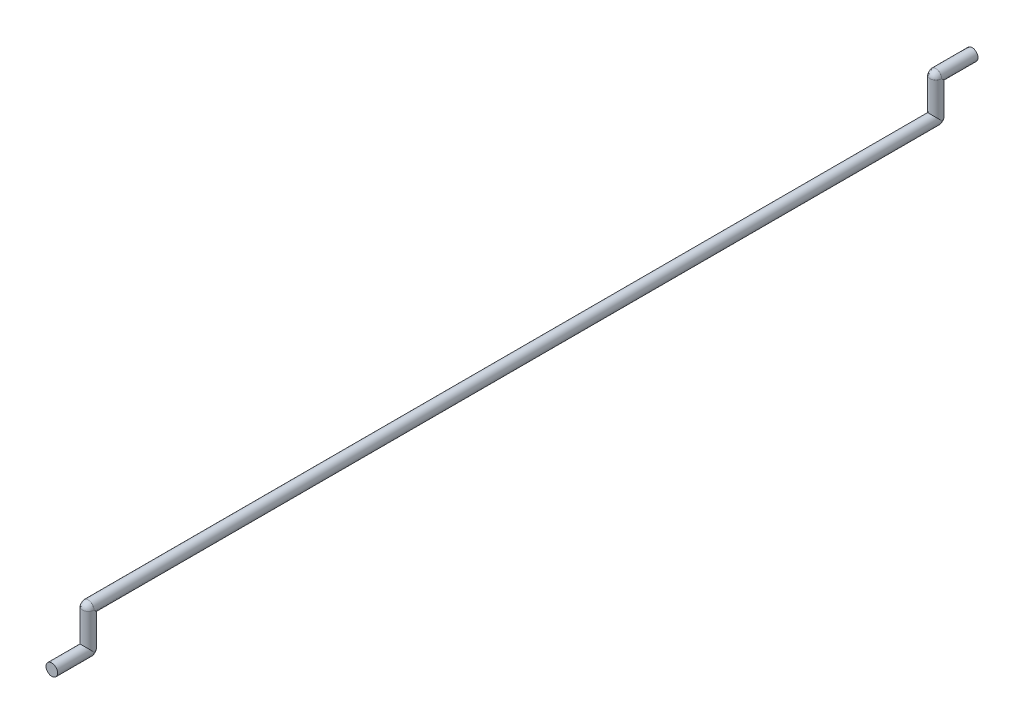
ISO-10303-21;
HEADER;
FILE_DESCRIPTION(('STEP AP214'),'2;1');
FILE_NAME('part.step','',(''),(''),'','','');
FILE_SCHEMA(('AUTOMOTIVE_DESIGN { 1 0 10303 214 1 1 1 1 }'));
ENDSEC;
DATA;
#1=APPLICATION_CONTEXT('core data for automotive mechanical design processes');
#2=APPLICATION_PROTOCOL_DEFINITION('international standard','automotive_design',2000,#1);
#3=PRODUCT_CONTEXT('',#1,'mechanical');
#4=PRODUCT('Part','Part','',(#3));
#5=PRODUCT_RELATED_PRODUCT_CATEGORY('part','',(#4));
#6=PRODUCT_DEFINITION_FORMATION('','',#4);
#7=PRODUCT_DEFINITION_CONTEXT('part definition',#1,'design');
#8=PRODUCT_DEFINITION('design','',#6,#7);
#9=PRODUCT_DEFINITION_SHAPE('','',#8);
#10=(LENGTH_UNIT() NAMED_UNIT(*) SI_UNIT(.MILLI.,.METRE.));
#11=(NAMED_UNIT(*) PLANE_ANGLE_UNIT() SI_UNIT($,.RADIAN.));
#12=(NAMED_UNIT(*) SI_UNIT($,.STERADIAN.) SOLID_ANGLE_UNIT());
#13=UNCERTAINTY_MEASURE_WITH_UNIT(LENGTH_MEASURE(1.E-05),#10,'distance_accuracy_value','');
#14=(GEOMETRIC_REPRESENTATION_CONTEXT(3) GLOBAL_UNCERTAINTY_ASSIGNED_CONTEXT((#13)) GLOBAL_UNIT_ASSIGNED_CONTEXT((#10,
#11,#12)) REPRESENTATION_CONTEXT('',''));
#15=CARTESIAN_POINT('',(0.,0.,0.));
#16=DIRECTION('',(0.,0.,1.));
#17=DIRECTION('',(1.,0.,0.));
#18=AXIS2_PLACEMENT_3D('',#15,#16,#17);
#19=CARTESIAN_POINT('',(0.,-2.54,29.591));
#20=DIRECTION('',(0.,1.,0.));
#21=DIRECTION('',(0.,0.,1.));
#22=AXIS2_PLACEMENT_3D('',#19,#20,#21);
#23=CYLINDRICAL_SURFACE('',#22,0.4064);
#24=CARTESIAN_POINT('',(-0.4064,0.,29.591));
#25=CARTESIAN_POINT('',(-0.4064,0.,29.6441976352546));
#26=CARTESIAN_POINT('',(-0.385247228577067,0.,29.7505931969916));
#27=CARTESIAN_POINT('',(-0.294884096127371,0.,29.8858240319345));
#28=CARTESIAN_POINT('',(-0.159580434220267,0.,29.9762683571422));
#29=CARTESIAN_POINT('',(-0.0531976352546505,0.,29.9974));
#30=CARTESIAN_POINT('',(0.0531976352546512,0.,29.9974));
#31=CARTESIAN_POINT('',(0.159593196991644,0.,29.9762472285771));
#32=CARTESIAN_POINT('',(0.294824031934544,0.,29.8858840961273));
#33=CARTESIAN_POINT('',(0.385268357142189,0.,29.7505804342203));
#34=CARTESIAN_POINT('',(0.4064,0.,29.6441976352546));
#35=CARTESIAN_POINT('',(0.4064,0.,29.591));
#36=B_SPLINE_CURVE_WITH_KNOTS('',3,(#24,#25,#26,#27,#28,#29,#30,#31,#32,#33,#34,#35),
.UNSPECIFIED.,.F.,.F.,(4,1,1,1,2,1,1,1,4),(0.,0.125,0.25,0.375,0.5,0.625,0.75,0.875,1.),.UNSPECIFIED.);
#37=CARTESIAN_POINT('',(-0.4064,0.,29.591));
#38=VERTEX_POINT('',#37);
#39=CARTESIAN_POINT('',(0.4064,0.,29.591));
#40=VERTEX_POINT('',#39);
#41=EDGE_CURVE('E162',#38,#40,#36,.T.);
#42=ORIENTED_EDGE('',*,*,#41,.F.);
#43=CARTESIAN_POINT('',(0.,0.,29.591));
#44=DIRECTION('',(0.,-0.707106781186548,0.707106781186547));
#45=DIRECTION('',(0.,0.707106781186548,0.707106781186547));
#46=AXIS2_PLACEMENT_3D('',#43,#44,#45);
#47=ELLIPSE('',#46,0.574736391748426,0.4064);
#48=EDGE_CURVE('E161',#38,#40,#47,.T.);
#49=ORIENTED_EDGE('',*,*,#48,.T.);
#50=EDGE_LOOP('',(#42,#49));
#51=FACE_BOUND('',#50,.T.);
#52=CARTESIAN_POINT('',(-0.4064,-2.54,29.591));
#53=CARTESIAN_POINT('',(-0.4064,-2.54,29.5378023647453));
#54=CARTESIAN_POINT('',(-0.38524722857707,-2.54,29.4314068030083));
#55=CARTESIAN_POINT('',(-0.294884096127375,-2.54,29.2961759680655));
#56=CARTESIAN_POINT('',(-0.159580434220265,-2.54,29.2057316428578));
#57=CARTESIAN_POINT('',(-0.0531976352546502,-2.54,29.1846));
#58=CARTESIAN_POINT('',(0.0531976352546497,-2.54,29.1846));
#59=CARTESIAN_POINT('',(0.159593196991646,-2.54,29.2057527714229));
#60=CARTESIAN_POINT('',(0.294824031934541,-2.54,29.2961159038726));
#61=CARTESIAN_POINT('',(0.385268357142195,-2.54,29.4314195657797));
#62=CARTESIAN_POINT('',(0.4064,-2.54,29.5378023647453));
#63=CARTESIAN_POINT('',(0.4064,-2.54,29.591));
#64=B_SPLINE_CURVE_WITH_KNOTS('',3,(#52,#53,#54,#55,#56,#57,#58,#59,#60,#61,#62,#63),
.UNSPECIFIED.,.F.,.F.,(4,1,1,1,2,1,1,1,4),(0.,0.125,0.25,0.375,0.5,0.625,0.75,0.875,1.),.UNSPECIFIED.);
#65=CARTESIAN_POINT('',(0.4064,-2.54,29.591));
#66=VERTEX_POINT('',#65);
#67=CARTESIAN_POINT('',(-0.4064,-2.54,29.591));
#68=VERTEX_POINT('',#67);
#69=EDGE_CURVE('E155',#66,#68,#64,.F.);
#70=ORIENTED_EDGE('',*,*,#69,.T.);
#71=CARTESIAN_POINT('',(0.,-2.54,29.591));
#72=DIRECTION('',(0.,0.707106781186547,-0.707106781186547));
#73=DIRECTION('',(0.,0.707106781186547,0.707106781186547));
#74=AXIS2_PLACEMENT_3D('',#71,#72,#73);
#75=ELLIPSE('',#74,0.574736391748426,0.4064);
#76=EDGE_CURVE('E165',#68,#66,#75,.T.);
#77=ORIENTED_EDGE('',*,*,#76,.T.);
#78=EDGE_LOOP('',(#70,#77));
#79=FACE_BOUND('',#78,.T.);
#80=ADVANCED_FACE('F113',(#51,#79),#23,.T.);
#81=CARTESIAN_POINT('',(0.,2.54,-29.591));
#82=DIRECTION('',(0.,-1.,0.));
#83=DIRECTION('',(0.,0.,-1.));
#84=AXIS2_PLACEMENT_3D('',#81,#82,#83);
#85=CYLINDRICAL_SURFACE('',#84,0.4064);
#86=CARTESIAN_POINT('',(0.,0.,-29.591));
#87=DIRECTION('',(0.,-0.707106781186548,0.707106781186547));
#88=DIRECTION('',(0.,0.707106781186548,0.707106781186547));
#89=AXIS2_PLACEMENT_3D('',#86,#87,#88);
#90=ELLIPSE('',#89,0.574736391748425,0.4064);
#91=CARTESIAN_POINT('',(0.4064,0.,-29.591));
#92=VERTEX_POINT('',#91);
#93=CARTESIAN_POINT('',(-0.4064,0.,-29.591));
#94=VERTEX_POINT('',#93);
#95=EDGE_CURVE('E259',#92,#94,#90,.T.);
#96=ORIENTED_EDGE('',*,*,#95,.F.);
#97=CARTESIAN_POINT('',(-0.4064,0.,-29.591));
#98=CARTESIAN_POINT('',(-0.4064,0.,-29.6441976352546));
#99=CARTESIAN_POINT('',(-0.385247228577067,0.,-29.7505931969917));
#100=CARTESIAN_POINT('',(-0.294884096127372,0.,-29.8858240319345));
#101=CARTESIAN_POINT('',(-0.159580434220266,0.,-29.9762683571422));
#102=CARTESIAN_POINT('',(-0.0531976352546507,0.,-29.9974));
#103=CARTESIAN_POINT('',(0.053197635254651,0.,-29.9974));
#104=CARTESIAN_POINT('',(0.159593196991646,0.,-29.9762472285771));
#105=CARTESIAN_POINT('',(0.294824031934539,0.,-29.8858840961274));
#106=CARTESIAN_POINT('',(0.385268357142194,0.,-29.7505804342203));
#107=CARTESIAN_POINT('',(0.4064,0.,-29.6441976352546));
#108=CARTESIAN_POINT('',(0.4064,0.,-29.591));
#109=B_SPLINE_CURVE_WITH_KNOTS('',3,(#97,#98,#99,#100,#101,#102,#103,#104,#105,#106,#107,#108),
.UNSPECIFIED.,.F.,.F.,(4,1,1,1,2,1,1,1,4),(0.,0.125,0.25,0.375,0.5,0.625,0.75,0.875,1.),.UNSPECIFIED.);
#110=EDGE_CURVE('E239',#92,#94,#109,.F.);
#111=ORIENTED_EDGE('',*,*,#110,.T.);
#112=EDGE_LOOP('',(#96,#111));
#113=FACE_BOUND('',#112,.T.);
#114=CARTESIAN_POINT('',(0.,2.54,-29.591));
#115=DIRECTION('',(0.,-0.707106781186547,0.707106781186547));
#116=DIRECTION('',(0.,-0.707106781186547,-0.707106781186547));
#117=AXIS2_PLACEMENT_3D('',#114,#115,#116);
#118=ELLIPSE('',#117,0.574736391748425,0.4064);
#119=CARTESIAN_POINT('',(0.4064,2.54,-29.591));
#120=VERTEX_POINT('',#119);
#121=CARTESIAN_POINT('',(-0.4064,2.54,-29.591));
#122=VERTEX_POINT('',#121);
#123=EDGE_CURVE('E251',#120,#122,#118,.F.);
#124=ORIENTED_EDGE('',*,*,#123,.F.);
#125=CARTESIAN_POINT('',(-0.4064,2.54,-29.591));
#126=CARTESIAN_POINT('',(-0.4064,2.54,-29.5378023647453));
#127=CARTESIAN_POINT('',(-0.385268357142192,2.54,-29.4314195657797));
#128=CARTESIAN_POINT('',(-0.294824031934538,2.54,-29.2961159038727));
#129=CARTESIAN_POINT('',(-0.159593196991654,2.54,-29.2057527714229));
#130=CARTESIAN_POINT('',(-0.0531976352546565,2.54,-29.1846));
#131=CARTESIAN_POINT('',(0.0531976352546435,2.54,-29.1846));
#132=CARTESIAN_POINT('',(0.159580434220258,2.54,-29.2057316428578));
#133=CARTESIAN_POINT('',(0.294884096127377,2.54,-29.2961759680654));
#134=CARTESIAN_POINT('',(0.385247228577072,2.54,-29.4314068030084));
#135=CARTESIAN_POINT('',(0.4064,2.54,-29.5378023647454));
#136=CARTESIAN_POINT('',(0.4064,2.54,-29.591));
#137=B_SPLINE_CURVE_WITH_KNOTS('',3,(#125,#126,#127,#128,#129,#130,#131,#132,#133,#134,#135,
#136),.UNSPECIFIED.,.F.,.F.,(4,1,1,1,2,1,1,1,4),(0.,0.125000000000017,0.250000000000033,
0.37500000000005,0.500000000000066,0.62500000000005,0.750000000000033,0.875000000000017,1.),.UNSPECIFIED.);
#138=EDGE_CURVE('E266',#122,#120,#137,.T.);
#139=ORIENTED_EDGE('',*,*,#138,.F.);
#140=EDGE_LOOP('',(#124,#139));
#141=FACE_BOUND('',#140,.T.);
#142=ADVANCED_FACE('F195',(#113,#141),#85,.T.);
#143=CARTESIAN_POINT('',(0.,0.,-29.591));
#144=DIRECTION('',(0.,0.,1.));
#145=DIRECTION('',(1.,0.,0.));
#146=AXIS2_PLACEMENT_3D('',#143,#144,#145);
#147=CYLINDRICAL_SURFACE('',#146,0.4064);
#148=ORIENTED_EDGE('',*,*,#48,.F.);
#149=CARTESIAN_POINT('',(0.4064,0.,29.591));
#150=CARTESIAN_POINT('',(0.4064,0.0531976352546506,29.591));
#151=CARTESIAN_POINT('',(0.385268357142195,0.159580434220266,29.591));
#152=CARTESIAN_POINT('',(0.294824031934539,0.294884096127372,29.5909999999999));
#153=CARTESIAN_POINT('',(0.159593196991646,0.385247228577068,29.591));
#154=CARTESIAN_POINT('',(0.0531976352546506,0.4064,29.591));
#155=CARTESIAN_POINT('',(-0.0531976352546505,0.4064,29.591));
#156=CARTESIAN_POINT('',(-0.159580434220266,0.385268357142195,29.5910000000001));
#157=CARTESIAN_POINT('',(-0.294884096127372,0.29482403193454,29.5909999999999));
#158=CARTESIAN_POINT('',(-0.385247228577068,0.159593196991646,29.5910000000001));
#159=CARTESIAN_POINT('',(-0.4064,0.0531976352546506,29.591));
#160=CARTESIAN_POINT('',(-0.4064,0.,29.591));
#161=B_SPLINE_CURVE_WITH_KNOTS('',3,(#149,#150,#151,#152,#153,#154,#155,#156,#157,#158,#159,
#160),.UNSPECIFIED.,.F.,.F.,(4,1,1,1,2,1,1,1,4),(0.,0.125,0.25,0.375,0.5,0.625,0.75,0.875,1.),.UNSPECIFIED.);
#162=EDGE_CURVE('E125',#40,#38,#161,.T.);
#163=ORIENTED_EDGE('',*,*,#162,.F.);
#164=EDGE_LOOP('',(#148,#163));
#165=FACE_BOUND('',#164,.T.);
#166=CARTESIAN_POINT('',(0.4064,0.,-29.591));
#167=CARTESIAN_POINT('',(0.4064,-0.0531976352546506,-29.591));
#168=CARTESIAN_POINT('',(0.385268357142195,-0.159580434220266,-29.591));
#169=CARTESIAN_POINT('',(0.29482403193454,-0.294884096127373,-29.591));
#170=CARTESIAN_POINT('',(0.159593196991646,-0.385247228577067,-29.591));
#171=CARTESIAN_POINT('',(0.0531976352546505,-0.4064,-29.591));
#172=CARTESIAN_POINT('',(-0.0531976352546506,-0.4064,-29.591));
#173=CARTESIAN_POINT('',(-0.159580434220266,-0.385268357142195,-29.5910000000001));
#174=CARTESIAN_POINT('',(-0.294884096127373,-0.294824031934539,-29.5909999999999));
#175=CARTESIAN_POINT('',(-0.385247228577068,-0.159593196991646,-29.591));
#176=CARTESIAN_POINT('',(-0.4064,-0.0531976352546506,-29.591));
#177=CARTESIAN_POINT('',(-0.4064,0.,-29.591));
#178=B_SPLINE_CURVE_WITH_KNOTS('',3,(#166,#167,#168,#169,#170,#171,#172,#173,#174,#175,#176,
#177),.UNSPECIFIED.,.F.,.F.,(4,1,1,1,2,1,1,1,4),(0.,0.125,0.25,0.375,0.5,0.625,0.75,0.875,1.),.UNSPECIFIED.);
#179=EDGE_CURVE('E13',#94,#92,#178,.F.);
#180=ORIENTED_EDGE('',*,*,#179,.T.);
#181=ORIENTED_EDGE('',*,*,#95,.T.);
#182=EDGE_LOOP('',(#180,#181));
#183=FACE_BOUND('',#182,.T.);
#184=ADVANCED_FACE('F115',(#165,#183),#147,.T.);
#185=CARTESIAN_POINT('',(0.,2.54,-32.131));
#186=DIRECTION('',(0.,0.,1.));
#187=DIRECTION('',(1.,0.,0.));
#188=AXIS2_PLACEMENT_3D('',#185,#186,#187);
#189=CYLINDRICAL_SURFACE('',#188,0.4064);
#190=CARTESIAN_POINT('',(0.,2.54,-32.131));
#191=DIRECTION('',(0.,0.,-1.));
#192=DIRECTION('',(-1.,0.,0.));
#193=AXIS2_PLACEMENT_3D('',#190,#191,#192);
#194=CIRCLE('',#193,0.4064);
#195=CARTESIAN_POINT('',(-0.4064,2.54,-32.131));
#196=VERTEX_POINT('',#195);
#197=EDGE_CURVE('E243',#196,#196,#194,.T.);
#198=ORIENTED_EDGE('',*,*,#197,.F.);
#199=EDGE_LOOP('',(#198));
#200=FACE_BOUND('',#199,.T.);
#201=CARTESIAN_POINT('',(0.4064,2.54,-29.591));
#202=CARTESIAN_POINT('',(0.4064,2.59319763525464,-29.591));
#203=CARTESIAN_POINT('',(0.385247228577074,2.69959319699161,-29.591));
#204=CARTESIAN_POINT('',(0.294884096127429,2.83482403193447,-29.591));
#205=CARTESIAN_POINT('',(0.159580434220393,2.92526835714214,-29.591));
#206=CARTESIAN_POINT('',(0.0531976352548125,2.94639999999998,-29.591));
#207=CARTESIAN_POINT('',(-0.0531976352544887,2.94640000000002,-29.591));
#208=CARTESIAN_POINT('',(-0.159593196991519,2.92524722857713,-29.591));
#209=CARTESIAN_POINT('',(-0.294824031934483,2.83488409612744,-29.591));
#210=CARTESIAN_POINT('',(-0.385268357142189,2.6995804342203,-29.5910000000001));
#211=CARTESIAN_POINT('',(-0.4064,2.59319763525466,-29.591));
#212=CARTESIAN_POINT('',(-0.4064,2.54,-29.591));
#213=B_SPLINE_CURVE_WITH_KNOTS('',3,(#201,#202,#203,#204,#205,#206,#207,#208,#209,#210,#211,
#212),.UNSPECIFIED.,.F.,.F.,(4,1,1,1,2,1,1,1,4),(0.,0.124999999999983,0.249999999999967,
0.37499999999995,0.499999999999934,0.62499999999995,0.749999999999967,0.874999999999983,1.),.UNSPECIFIED.);
#214=EDGE_CURVE('E252',#122,#120,#213,.F.);
#215=ORIENTED_EDGE('',*,*,#214,.T.);
#216=ORIENTED_EDGE('',*,*,#123,.T.);
#217=EDGE_LOOP('',(#215,#216));
#218=FACE_BOUND('',#217,.T.);
#219=ADVANCED_FACE('F284',(#200,#218),#189,.T.);
#220=CARTESIAN_POINT('',(0.,2.54,-32.131));
#221=DIRECTION('',(0.,0.,-1.));
#222=DIRECTION('',(-1.,0.,0.));
#223=AXIS2_PLACEMENT_3D('',#220,#221,#222);
#224=PLANE('',#223);
#225=ORIENTED_EDGE('',*,*,#197,.T.);
#226=EDGE_LOOP('',(#225));
#227=FACE_BOUND('',#226,.T.);
#228=ADVANCED_FACE('F367',(#227),#224,.T.);
#229=CARTESIAN_POINT('',(0.4064,0.,-29.591));
#230=CARTESIAN_POINT('',(0.4064,0.,-29.591));
#231=CARTESIAN_POINT('',(0.4064,0.,-29.591));
#232=CARTESIAN_POINT('',(0.4064,0.,-29.591));
#233=CARTESIAN_POINT('',(0.4064,-0.0531976352546506,-29.591));
#234=CARTESIAN_POINT('',(0.4064,-0.035465090169767,-29.6087325450849));
#235=CARTESIAN_POINT('',(0.4064,-0.0177325450848835,-29.6264650901698));
#236=CARTESIAN_POINT('',(0.4064,0.,-29.6441976352546));
#237=CARTESIAN_POINT('',(0.385268357142195,-0.159580434220266,-29.591));
#238=CARTESIAN_POINT('',(0.385268357142194,-0.123453508583309,-29.6542458722392));
#239=CARTESIAN_POINT('',(0.385268357142194,-0.0632458722391896,-29.7144535085833));
#240=CARTESIAN_POINT('',(0.385268357142194,0.,-29.7505804342203));
#241=CARTESIAN_POINT('',(0.29482403193454,-0.294884096127373,-29.591));
#242=CARTESIAN_POINT('',(0.29482403193454,-0.264855607164108,-29.7295042753722));
#243=CARTESIAN_POINT('',(0.29482403193454,-0.138504275372196,-29.8558556071641));
#244=CARTESIAN_POINT('',(0.294824031934539,0.,-29.8858840961274));
#245=CARTESIAN_POINT('',(0.159593196991646,-0.385247228577067,-29.591));
#246=CARTESIAN_POINT('',(0.159593196991646,-0.376297352773299,-29.7897825020194));
#247=CARTESIAN_POINT('',(0.159593196991646,-0.198782502019397,-29.9672973527733));
#248=CARTESIAN_POINT('',(0.159593196991646,0.,-29.9762472285771));
#249=CARTESIAN_POINT('',(0.0531976352546505,-0.4064,-29.591));
#250=CARTESIAN_POINT('',(0.0531976352546507,-0.407465752825052,-29.8068858199928));
#251=CARTESIAN_POINT('',(0.0531976352546508,-0.215885819992809,-29.9984657528251));
#252=CARTESIAN_POINT('',(0.053197635254651,0.,-29.9974));
#253=CARTESIAN_POINT('',(-0.0531976352546506,-0.4064,-29.591));
#254=CARTESIAN_POINT('',(-0.0531976352546506,-0.407465752825052,-29.8068858199928));
#255=CARTESIAN_POINT('',(-0.0531976352546507,-0.215885819992809,-29.9984657528251));
#256=CARTESIAN_POINT('',(-0.0531976352546507,0.,-29.9974));
#257=CARTESIAN_POINT('',(-0.159580434220266,-0.385268357142195,-29.5910000000001));
#258=CARTESIAN_POINT('',(-0.159580434220266,-0.376311438483384,-29.7897895448745));
#259=CARTESIAN_POINT('',(-0.159580434220266,-0.198789544874439,-29.9673114384834));
#260=CARTESIAN_POINT('',(-0.159580434220266,0.,-29.9762683571422));
#261=CARTESIAN_POINT('',(-0.294884096127373,-0.294824031934539,-29.5909999999999));
#262=CARTESIAN_POINT('',(-0.294884096127372,-0.264815564368886,-29.7294842539745));
#263=CARTESIAN_POINT('',(-0.294884096127372,-0.138484253974584,-29.8558155643689));
#264=CARTESIAN_POINT('',(-0.294884096127372,0.,-29.8858240319345));
#265=CARTESIAN_POINT('',(-0.385247228577068,-0.159593196991646,-29.591));
#266=CARTESIAN_POINT('',(-0.385247228577067,-0.123462017097562,-29.6542501264963));
#267=CARTESIAN_POINT('',(-0.385247228577067,-0.0632501264963165,-29.7144620170976));
#268=CARTESIAN_POINT('',(-0.385247228577067,0.,-29.7505931969917));
#269=CARTESIAN_POINT('',(-0.4064,-0.0531976352546506,-29.591));
#270=CARTESIAN_POINT('',(-0.4064,-0.035465090169767,-29.6087325450849));
#271=CARTESIAN_POINT('',(-0.4064,-0.0177325450848835,-29.6264650901698));
#272=CARTESIAN_POINT('',(-0.4064,0.,-29.6441976352546));
#273=CARTESIAN_POINT('',(-0.4064,0.,-29.591));
#274=CARTESIAN_POINT('',(-0.4064,0.,-29.591));
#275=CARTESIAN_POINT('',(-0.4064,0.,-29.591));
#276=CARTESIAN_POINT('',(-0.4064,0.,-29.591));
#277=B_SPLINE_SURFACE_WITH_KNOTS('',3,3,((#229,#230,#231,#232),(#233,#234,#235,#236),(#237,#238,
#239,#240),(#241,#242,#243,#244),(#245,#246,#247,#248),(#249,#250,#251,#252),(#253,#254,#255,
#256),(#257,#258,#259,#260),(#261,#262,#263,#264),(#265,#266,#267,#268),(#269,#270,#271,#272),
(#273,#274,#275,#276)),.UNSPECIFIED.,.F.,.F.,.F.,(4,1,1,1,2,1,1,1,4),(4,4),(0.,0.125,0.25,0.375,
0.5,0.625,0.75,0.875,1.),(0.,1.),.UNSPECIFIED.);
#278=ORIENTED_EDGE('',*,*,#179,.F.);
#279=ORIENTED_EDGE('',*,*,#110,.F.);
#280=EDGE_LOOP('',(#278,#279));
#281=FACE_BOUND('',#280,.T.);
#282=ADVANCED_FACE('F203',(#281),#277,.T.);
#283=CARTESIAN_POINT('',(-0.4064,2.54,-29.591));
#284=CARTESIAN_POINT('',(-0.4064,2.54,-29.591));
#285=CARTESIAN_POINT('',(-0.4064,2.54,-29.591));
#286=CARTESIAN_POINT('',(-0.4064,2.54,-29.591));
#287=CARTESIAN_POINT('',(-0.4064,2.54,-29.5378023647453));
#288=CARTESIAN_POINT('',(-0.4064,2.55773254508489,-29.5555349098302));
#289=CARTESIAN_POINT('',(-0.4064,2.57546509016977,-29.5732674549151));
#290=CARTESIAN_POINT('',(-0.4064,2.59319763525466,-29.591));
#291=CARTESIAN_POINT('',(-0.385268357142192,2.54,-29.4314195657797));
#292=CARTESIAN_POINT('',(-0.385268357142198,2.60327115458553,-29.4674275848629));
#293=CARTESIAN_POINT('',(-0.385268357142204,2.66354555395622,-29.5277291477029));
#294=CARTESIAN_POINT('',(-0.385268357142189,2.6995804342203,-29.5910000000001));
#295=CARTESIAN_POINT('',(-0.294824031934538,2.54,-29.2961159038727));
#296=CARTESIAN_POINT('',(-0.294824031934548,2.67860540475751,-29.3256687666208));
#297=CARTESIAN_POINT('',(-0.294824031934558,2.8052237886557,-29.4523958043961));
#298=CARTESIAN_POINT('',(-0.294824031934483,2.83488409612744,-29.591));
#299=CARTESIAN_POINT('',(-0.159593196991654,2.54,-29.2057527714229));
#300=CARTESIAN_POINT('',(-0.159593196991659,2.73895947844368,-29.2138703013502));
#301=CARTESIAN_POINT('',(-0.159593196991663,2.91694167038356,-29.3920426375752));
#302=CARTESIAN_POINT('',(-0.159593196991519,2.92524722857713,-29.591));
#303=CARTESIAN_POINT('',(-0.0531976352546565,2.54,-29.1846));
#304=CARTESIAN_POINT('',(-0.0531976352546573,2.75608807876341,-29.1825829947447));
#305=CARTESIAN_POINT('',(-0.0531976352546575,2.94820211580817,-29.3749143395438));
#306=CARTESIAN_POINT('',(-0.0531976352544887,2.94640000000002,-29.591));
#307=CARTESIAN_POINT('',(0.0531976352546435,2.54,-29.1846));
#308=CARTESIAN_POINT('',(0.0531976352546432,2.75608807876339,-29.1825829947447));
#309=CARTESIAN_POINT('',(0.0531976352546434,2.94820211580814,-29.3749143395438));
#310=CARTESIAN_POINT('',(0.0531976352548125,2.94639999999998,-29.591));
#311=CARTESIAN_POINT('',(0.159580434220258,2.54,-29.2057316428578));
#312=CARTESIAN_POINT('',(0.159580434220254,2.73896652129869,-29.2138562156401));
#313=CARTESIAN_POINT('',(0.15958043422025,2.91695575609356,-29.3920355947201));
#314=CARTESIAN_POINT('',(0.159580434220393,2.92526835714214,-29.591));
#315=CARTESIAN_POINT('',(0.294884096127377,2.54,-29.2961759680654));
#316=CARTESIAN_POINT('',(0.294884096127366,2.67858538335985,-29.325708809416));
#317=CARTESIAN_POINT('',(0.294884096127356,2.80518374586039,-29.4524158257937));
#318=CARTESIAN_POINT('',(0.294884096127429,2.83482403193447,-29.591));
#319=CARTESIAN_POINT('',(0.385247228577072,2.54,-29.4314068030084));
#320=CARTESIAN_POINT('',(0.385247228577066,2.60327540884263,-29.4674190763487));
#321=CARTESIAN_POINT('',(0.385247228577059,2.66355406247043,-29.5277248934458));
#322=CARTESIAN_POINT('',(0.385247228577074,2.69959319699161,-29.591));
#323=CARTESIAN_POINT('',(0.4064,2.54,-29.5378023647454));
#324=CARTESIAN_POINT('',(0.4064,2.55773254508488,-29.5555349098302));
#325=CARTESIAN_POINT('',(0.4064,2.57546509016976,-29.5732674549151));
#326=CARTESIAN_POINT('',(0.4064,2.59319763525464,-29.591));
#327=CARTESIAN_POINT('',(0.4064,2.54,-29.591));
#328=CARTESIAN_POINT('',(0.4064,2.54,-29.591));
#329=CARTESIAN_POINT('',(0.4064,2.54,-29.591));
#330=CARTESIAN_POINT('',(0.4064,2.54,-29.591));
#331=B_SPLINE_SURFACE_WITH_KNOTS('',3,3,((#283,#284,#285,#286),(#287,#288,#289,#290),(#291,#292,
#293,#294),(#295,#296,#297,#298),(#299,#300,#301,#302),(#303,#304,#305,#306),(#307,#308,#309,
#310),(#311,#312,#313,#314),(#315,#316,#317,#318),(#319,#320,#321,#322),(#323,#324,#325,#326),
(#327,#328,#329,#330)),.UNSPECIFIED.,.F.,.F.,.F.,(4,1,1,1,2,1,1,1,4),(4,4),(0.,
0.125000000000017,0.250000000000033,0.37500000000005,0.500000000000066,0.62500000000005,
0.750000000000033,0.875000000000017,1.),(0.,1.),.UNSPECIFIED.);
#332=ORIENTED_EDGE('',*,*,#138,.T.);
#333=ORIENTED_EDGE('',*,*,#214,.F.);
#334=EDGE_LOOP('',(#332,#333));
#335=FACE_BOUND('',#334,.T.);
#336=ADVANCED_FACE('F190',(#335),#331,.T.);
#337=CARTESIAN_POINT('',(0.,-2.54,32.131));
#338=DIRECTION('',(0.,0.,-1.));
#339=DIRECTION('',(-1.,0.,0.));
#340=AXIS2_PLACEMENT_3D('',#337,#338,#339);
#341=CYLINDRICAL_SURFACE('',#340,0.4064);
#342=ORIENTED_EDGE('',*,*,#76,.F.);
#343=CARTESIAN_POINT('',(0.4064,-2.54,29.591));
#344=CARTESIAN_POINT('',(0.4064,-2.59319763525465,29.591));
#345=CARTESIAN_POINT('',(0.385268357142194,-2.69958043422026,29.591));
#346=CARTESIAN_POINT('',(0.29482403193454,-2.83488409612737,29.591));
#347=CARTESIAN_POINT('',(0.159593196991646,-2.92524722857707,29.591));
#348=CARTESIAN_POINT('',(0.0531976352546504,-2.9464,29.591));
#349=CARTESIAN_POINT('',(-0.0531976352546509,-2.9464,29.591));
#350=CARTESIAN_POINT('',(-0.159580434220266,-2.92526835714219,29.591));
#351=CARTESIAN_POINT('',(-0.294884096127373,-2.83482403193454,29.591));
#352=CARTESIAN_POINT('',(-0.385247228577068,-2.69959319699164,29.591));
#353=CARTESIAN_POINT('',(-0.4064,-2.59319763525465,29.591));
#354=CARTESIAN_POINT('',(-0.4064,-2.54,29.591));
#355=B_SPLINE_CURVE_WITH_KNOTS('',3,(#343,#344,#345,#346,#347,#348,#349,#350,#351,#352,#353,
#354),.UNSPECIFIED.,.F.,.F.,(4,1,1,1,2,1,1,1,4),(0.,0.125,0.25,0.375,0.5,0.625,0.75,0.875,1.),.UNSPECIFIED.);
#356=EDGE_CURVE('E131',#68,#66,#355,.F.);
#357=ORIENTED_EDGE('',*,*,#356,.T.);
#358=EDGE_LOOP('',(#342,#357));
#359=FACE_BOUND('',#358,.T.);
#360=CARTESIAN_POINT('',(0.,-2.54,32.131));
#361=DIRECTION('',(0.,0.,1.));
#362=DIRECTION('',(1.,0.,0.));
#363=AXIS2_PLACEMENT_3D('',#360,#361,#362);
#364=CIRCLE('',#363,0.4064);
#365=CARTESIAN_POINT('',(0.4064,-2.54,32.131));
#366=VERTEX_POINT('',#365);
#367=EDGE_CURVE('E167',#366,#366,#364,.T.);
#368=ORIENTED_EDGE('',*,*,#367,.F.);
#369=EDGE_LOOP('',(#368));
#370=FACE_BOUND('',#369,.T.);
#371=ADVANCED_FACE('F170',(#359,#370),#341,.T.);
#372=CARTESIAN_POINT('',(0.,-2.54,32.131));
#373=DIRECTION('',(0.,0.,1.));
#374=DIRECTION('',(1.,0.,0.));
#375=AXIS2_PLACEMENT_3D('',#372,#373,#374);
#376=PLANE('',#375);
#377=ORIENTED_EDGE('',*,*,#367,.T.);
#378=EDGE_LOOP('',(#377));
#379=FACE_BOUND('',#378,.T.);
#380=ADVANCED_FACE('F189',(#379),#376,.T.);
#381=CARTESIAN_POINT('',(0.4064,0.,29.591));
#382=CARTESIAN_POINT('',(0.4064,0.,29.591));
#383=CARTESIAN_POINT('',(0.4064,0.,29.591));
#384=CARTESIAN_POINT('',(0.4064,0.,29.591));
#385=CARTESIAN_POINT('',(0.4064,0.0531976352546506,29.591));
#386=CARTESIAN_POINT('',(0.4064,0.0354650901697671,29.6087325450849));
#387=CARTESIAN_POINT('',(0.4064,0.0177325450848835,29.6264650901698));
#388=CARTESIAN_POINT('',(0.4064,0.,29.6441976352546));
#389=CARTESIAN_POINT('',(0.385268357142195,0.159580434220266,29.591));
#390=CARTESIAN_POINT('',(0.385268357142193,0.123275337096876,29.6552789669475));
#391=CARTESIAN_POINT('',(0.385268357142191,0.0642789669474441,29.7142753370969));
#392=CARTESIAN_POINT('',(0.385268357142189,0.,29.7505804342203));
#393=CARTESIAN_POINT('',(0.294824031934539,0.294884096127372,29.5909999999999));
#394=CARTESIAN_POINT('',(0.294824031934541,0.264142921218374,29.7336366542052));
#395=CARTESIAN_POINT('',(0.294824031934543,0.142636654205212,29.8551429212183));
#396=CARTESIAN_POINT('',(0.294824031934544,0.,29.8858840961273));
#397=CARTESIAN_POINT('',(0.159593196991646,0.385247228577068,29.591));
#398=CARTESIAN_POINT('',(0.159593196991645,0.375050152368265,29.7970141649772));
#399=CARTESIAN_POINT('',(0.159593196991644,0.206014164977176,29.9660501523683));
#400=CARTESIAN_POINT('',(0.159593196991644,0.,29.9762472285771));
#401=CARTESIAN_POINT('',(0.0531976352546506,0.4064,29.591));
#402=CARTESIAN_POINT('',(0.0531976352546507,0.406040380933585,29.8151505776588));
#403=CARTESIAN_POINT('',(0.0531976352546508,0.224150577658842,29.9970403809336));
#404=CARTESIAN_POINT('',(0.0531976352546512,0.,29.9974));
#405=CARTESIAN_POINT('',(-0.0531976352546505,0.4064,29.591));
#406=CARTESIAN_POINT('',(-0.0531976352546507,0.406040380933585,29.8151505776588));
#407=CARTESIAN_POINT('',(-0.0531976352546508,0.224150577658842,29.9970403809336));
#408=CARTESIAN_POINT('',(-0.0531976352546505,0.,29.9974));
#409=CARTESIAN_POINT('',(-0.159580434220266,0.385268357142195,29.5910000000001));
#410=CARTESIAN_POINT('',(-0.159580434220267,0.37506423807835,29.7970212078323));
#411=CARTESIAN_POINT('',(-0.159580434220267,0.206021207832219,29.9660642380784));
#412=CARTESIAN_POINT('',(-0.159580434220267,0.,29.9762683571422));
#413=CARTESIAN_POINT('',(-0.294884096127372,0.29482403193454,29.5909999999999));
#414=CARTESIAN_POINT('',(-0.294884096127372,0.264102878423152,29.7336166328075));
#415=CARTESIAN_POINT('',(-0.294884096127372,0.142616632807601,29.8551028784231));
#416=CARTESIAN_POINT('',(-0.294884096127371,0.,29.8858240319345));
#417=CARTESIAN_POINT('',(-0.385247228577068,0.159593196991646,29.5910000000001));
#418=CARTESIAN_POINT('',(-0.385247228577068,0.123283845611129,29.6552832212046));
#419=CARTESIAN_POINT('',(-0.385247228577068,0.0642832212045706,29.7142838456111));
#420=CARTESIAN_POINT('',(-0.385247228577067,0.,29.7505931969916));
#421=CARTESIAN_POINT('',(-0.4064,0.0531976352546506,29.591));
#422=CARTESIAN_POINT('',(-0.4064,0.0354650901697671,29.6087325450849));
#423=CARTESIAN_POINT('',(-0.4064,0.0177325450848835,29.6264650901698));
#424=CARTESIAN_POINT('',(-0.4064,0.,29.6441976352546));
#425=CARTESIAN_POINT('',(-0.4064,0.,29.591));
#426=CARTESIAN_POINT('',(-0.4064,0.,29.591));
#427=CARTESIAN_POINT('',(-0.4064,0.,29.591));
#428=CARTESIAN_POINT('',(-0.4064,0.,29.591));
#429=B_SPLINE_SURFACE_WITH_KNOTS('',3,3,((#381,#382,#383,#384),(#385,#386,#387,#388),(#389,#390,
#391,#392),(#393,#394,#395,#396),(#397,#398,#399,#400),(#401,#402,#403,#404),(#405,#406,#407,
#408),(#409,#410,#411,#412),(#413,#414,#415,#416),(#417,#418,#419,#420),(#421,#422,#423,#424),
(#425,#426,#427,#428)),.UNSPECIFIED.,.F.,.F.,.F.,(4,1,1,1,2,1,1,1,4),(4,4),(0.,0.125,0.25,0.375,
0.5,0.625,0.75,0.875,1.),(0.,1.),.UNSPECIFIED.);
#430=ORIENTED_EDGE('',*,*,#162,.T.);
#431=ORIENTED_EDGE('',*,*,#41,.T.);
#432=EDGE_LOOP('',(#430,#431));
#433=FACE_BOUND('',#432,.T.);
#434=ADVANCED_FACE('F330',(#433),#429,.T.);
#435=CARTESIAN_POINT('',(0.4064,-2.54,29.591));
#436=CARTESIAN_POINT('',(0.4064,-2.54,29.591));
#437=CARTESIAN_POINT('',(0.4064,-2.54,29.591));
#438=CARTESIAN_POINT('',(0.4064,-2.54,29.591));
#439=CARTESIAN_POINT('',(0.4064,-2.59319763525465,29.591));
#440=CARTESIAN_POINT('',(0.4064,-2.57546509016977,29.5732674549151));
#441=CARTESIAN_POINT('',(0.4064,-2.55773254508488,29.5555349098302));
#442=CARTESIAN_POINT('',(0.4064,-2.54,29.5378023647453));
#443=CARTESIAN_POINT('',(0.385268357142194,-2.69958043422026,29.591));
#444=CARTESIAN_POINT('',(0.385268357142194,-2.66396960391531,29.5276012660168));
#445=CARTESIAN_POINT('',(0.385268357142194,-2.60339873398319,29.4670303960847));
#446=CARTESIAN_POINT('',(0.385268357142195,-2.54,29.4314195657797));
#447=CARTESIAN_POINT('',(0.29482403193454,-2.83488409612737,29.591));
#448=CARTESIAN_POINT('',(0.29482403193454,-2.80691998849211,29.4518842776518));
#449=CARTESIAN_POINT('',(0.294824031934541,-2.67911572234819,29.3240800115079));
#450=CARTESIAN_POINT('',(0.294824031934541,-2.54,29.2961159038726));
#451=CARTESIAN_POINT('',(0.159593196991646,-2.92524722857707,29.591));
#452=CARTESIAN_POINT('',(0.159593196991646,-2.9199100200973,29.3911474657726));
#453=CARTESIAN_POINT('',(0.159593196991646,-2.73985253422738,29.2110899799027));
#454=CARTESIAN_POINT('',(0.159593196991646,-2.54,29.2057527714229));
#455=CARTESIAN_POINT('',(0.0531976352546504,-2.9464,29.591));
#456=CARTESIAN_POINT('',(0.0531976352546504,-2.95159451548105,29.3738912860552));
#457=CARTESIAN_POINT('',(0.0531976352546501,-2.75710871394479,29.179405484519));
#458=CARTESIAN_POINT('',(0.0531976352546497,-2.54,29.1846));
#459=CARTESIAN_POINT('',(-0.0531976352546509,-2.9464,29.591));
#460=CARTESIAN_POINT('',(-0.0531976352546504,-2.95159451548105,29.3738912860552));
#461=CARTESIAN_POINT('',(-0.0531976352546502,-2.75710871394479,29.179405484519));
#462=CARTESIAN_POINT('',(-0.0531976352546502,-2.54,29.1846));
#463=CARTESIAN_POINT('',(-0.159580434220266,-2.92526835714219,29.591));
#464=CARTESIAN_POINT('',(-0.159580434220266,-2.91992410580738,29.3911404229176));
#465=CARTESIAN_POINT('',(-0.159580434220265,-2.73985957708242,29.2110758941926));
#466=CARTESIAN_POINT('',(-0.159580434220265,-2.54,29.2057316428578));
#467=CARTESIAN_POINT('',(-0.294884096127373,-2.83482403193454,29.591));
#468=CARTESIAN_POINT('',(-0.294884096127374,-2.80687994569689,29.4519042990494));
#469=CARTESIAN_POINT('',(-0.294884096127374,-2.67909570095058,29.3241200543031));
#470=CARTESIAN_POINT('',(-0.294884096127375,-2.54,29.2961759680655));
#471=CARTESIAN_POINT('',(-0.385247228577068,-2.69959319699164,29.591));
#472=CARTESIAN_POINT('',(-0.385247228577068,-2.66397811242956,29.5275970117597));
#473=CARTESIAN_POINT('',(-0.385247228577069,-2.60340298824031,29.4670218875704));
#474=CARTESIAN_POINT('',(-0.38524722857707,-2.54,29.4314068030083));
#475=CARTESIAN_POINT('',(-0.4064,-2.59319763525465,29.591));
#476=CARTESIAN_POINT('',(-0.4064,-2.57546509016977,29.5732674549151));
#477=CARTESIAN_POINT('',(-0.4064,-2.55773254508488,29.5555349098302));
#478=CARTESIAN_POINT('',(-0.4064,-2.54,29.5378023647453));
#479=CARTESIAN_POINT('',(-0.4064,-2.54,29.591));
#480=CARTESIAN_POINT('',(-0.4064,-2.54,29.591));
#481=CARTESIAN_POINT('',(-0.4064,-2.54,29.591));
#482=CARTESIAN_POINT('',(-0.4064,-2.54,29.591));
#483=B_SPLINE_SURFACE_WITH_KNOTS('',3,3,((#435,#436,#437,#438),(#439,#440,#441,#442),(#443,#444,
#445,#446),(#447,#448,#449,#450),(#451,#452,#453,#454),(#455,#456,#457,#458),(#459,#460,#461,
#462),(#463,#464,#465,#466),(#467,#468,#469,#470),(#471,#472,#473,#474),(#475,#476,#477,#478),
(#479,#480,#481,#482)),.UNSPECIFIED.,.F.,.F.,.F.,(4,1,1,1,2,1,1,1,4),(4,4),(0.,0.125,0.25,0.375,
0.5,0.625,0.75,0.875,1.),(0.,1.),.UNSPECIFIED.);
#484=ORIENTED_EDGE('',*,*,#356,.F.);
#485=ORIENTED_EDGE('',*,*,#69,.F.);
#486=EDGE_LOOP('',(#484,#485));
#487=FACE_BOUND('',#486,.T.);
#488=ADVANCED_FACE('F158',(#487),#483,.T.);
#489=CLOSED_SHELL('',(#80,#142,#184,#219,#228,#282,#336,#371,#380,#434,#488));
#490=MANIFOLD_SOLID_BREP('B2',#489);
#491=ADVANCED_BREP_SHAPE_REPRESENTATION('',(#18,#490),#14);
#492=SHAPE_DEFINITION_REPRESENTATION(#9,#491);
ENDSEC;
END-ISO-10303-21;
